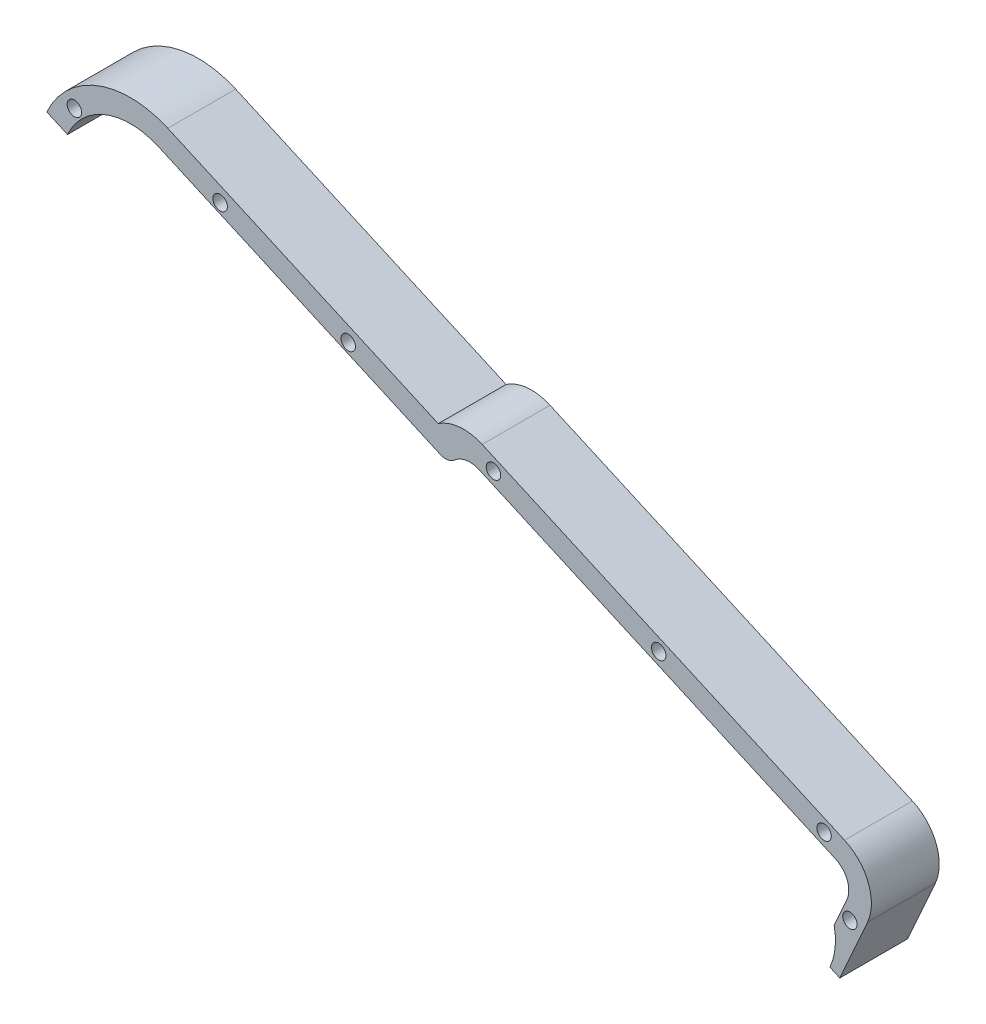
ISO-10303-21;
HEADER;
FILE_DESCRIPTION(('STEP AP214'),'2;1');
FILE_NAME('part.step','',(''),(''),'','','');
FILE_SCHEMA(('AUTOMOTIVE_DESIGN { 1 0 10303 214 1 1 1 1 }'));
ENDSEC;
DATA;
#1=APPLICATION_CONTEXT('core data for automotive mechanical design processes');
#2=APPLICATION_PROTOCOL_DEFINITION('international standard','automotive_design',2000,#1);
#3=PRODUCT_CONTEXT('',#1,'mechanical');
#4=PRODUCT('Part','Part','',(#3));
#5=PRODUCT_RELATED_PRODUCT_CATEGORY('part','',(#4));
#6=PRODUCT_DEFINITION_FORMATION('','',#4);
#7=PRODUCT_DEFINITION_CONTEXT('part definition',#1,'design');
#8=PRODUCT_DEFINITION('design','',#6,#7);
#9=PRODUCT_DEFINITION_SHAPE('','',#8);
#10=(LENGTH_UNIT() NAMED_UNIT(*) SI_UNIT(.MILLI.,.METRE.));
#11=(NAMED_UNIT(*) PLANE_ANGLE_UNIT() SI_UNIT($,.RADIAN.));
#12=(NAMED_UNIT(*) SI_UNIT($,.STERADIAN.) SOLID_ANGLE_UNIT());
#13=UNCERTAINTY_MEASURE_WITH_UNIT(LENGTH_MEASURE(1.E-05),#10,'distance_accuracy_value','');
#14=(GEOMETRIC_REPRESENTATION_CONTEXT(3) GLOBAL_UNCERTAINTY_ASSIGNED_CONTEXT((#13)) GLOBAL_UNIT_ASSIGNED_CONTEXT((#10,
#11,#12)) REPRESENTATION_CONTEXT('',''));
#15=CARTESIAN_POINT('',(0.,0.,0.));
#16=DIRECTION('',(0.,0.,1.));
#17=DIRECTION('',(1.,0.,0.));
#18=AXIS2_PLACEMENT_3D('',#15,#16,#17);
#19=CARTESIAN_POINT('',(-76.7868238041878,81.7037234737728,0.));
#20=DIRECTION('',(0.,0.,1.));
#21=DIRECTION('',(1.,0.,0.));
#22=AXIS2_PLACEMENT_3D('',#19,#20,#21);
#23=CYLINDRICAL_SURFACE('',#22,5.00000000000001);
#24=CARTESIAN_POINT('',(-76.7868238041878,81.7037234737728,15.));
#25=DIRECTION('',(0.,0.,-1.));
#26=DIRECTION('',(-1.,0.,0.));
#27=AXIS2_PLACEMENT_3D('',#24,#25,#26);
#28=CIRCLE('',#27,5.00000000000001);
#29=CARTESIAN_POINT('',(-74.7510627846422,86.27052509759,15.));
#30=VERTEX_POINT('',#29);
#31=CARTESIAN_POINT('',(-72.2200221803707,79.6679624542272,15.));
#32=VERTEX_POINT('',#31);
#33=EDGE_CURVE('E177',#30,#32,#28,.T.);
#34=ORIENTED_EDGE('',*,*,#33,.F.);
#35=DIRECTION('',(0.,0.,1.));
#36=VECTOR('',#35,1.);
#37=CARTESIAN_POINT('',(-74.7510627846422,86.27052509759,0.));
#38=LINE('',#37,#36);
#39=CARTESIAN_POINT('',(-74.7510627846422,86.27052509759,0.));
#40=VERTEX_POINT('',#39);
#41=EDGE_CURVE('E11',#40,#30,#38,.T.);
#42=ORIENTED_EDGE('',*,*,#41,.F.);
#43=CARTESIAN_POINT('',(-76.7868238041878,81.7037234737728,0.));
#44=DIRECTION('',(0.,0.,-1.));
#45=DIRECTION('',(-1.,0.,0.));
#46=AXIS2_PLACEMENT_3D('',#43,#44,#45);
#47=CIRCLE('',#46,5.00000000000001);
#48=CARTESIAN_POINT('',(-72.2200221803707,79.6679624542272,0.));
#49=VERTEX_POINT('',#48);
#50=EDGE_CURVE('E222',#40,#49,#47,.T.);
#51=ORIENTED_EDGE('',*,*,#50,.T.);
#52=DIRECTION('',(0.,0.,1.));
#53=VECTOR('',#52,1.);
#54=CARTESIAN_POINT('',(-72.2200221803707,79.6679624542272,0.));
#55=LINE('',#54,#53);
#56=EDGE_CURVE('E35',#49,#32,#55,.T.);
#57=ORIENTED_EDGE('',*,*,#56,.T.);
#58=EDGE_LOOP('',(#34,#42,#51,#57));
#59=FACE_BOUND('',#58,.T.);
#60=ADVANCED_FACE('F32',(#59),#23,.F.);
#61=CARTESIAN_POINT('',(-153.49279007904,121.371532814155,0.));
#62=DIRECTION('',(-0.40715220390912,-0.913360324763424,0.));
#63=DIRECTION('',(0.913360324763424,-0.40715220390912,0.));
#64=AXIS2_PLACEMENT_3D('',#61,#62,#63);
#65=PLANE('',#64);
#66=DIRECTION('',(0.913360324763424,-0.40715220390912,0.));
#67=VECTOR('',#66,1.);
#68=CARTESIAN_POINT('',(-153.49279007904,121.371532814155,15.));
#69=LINE('',#68,#67);
#70=CARTESIAN_POINT('',(-153.49279007904,121.371532814155,15.));
#71=VERTEX_POINT('',#70);
#72=EDGE_CURVE('E220',#71,#30,#69,.T.);
#73=ORIENTED_EDGE('',*,*,#72,.F.);
#74=DIRECTION('',(0.,0.,1.));
#75=VECTOR('',#74,1.);
#76=CARTESIAN_POINT('',(-153.49279007904,121.371532814155,0.));
#77=LINE('',#76,#75);
#78=CARTESIAN_POINT('',(-153.49279007904,121.371532814155,0.));
#79=VERTEX_POINT('',#78);
#80=EDGE_CURVE('E41',#79,#71,#77,.T.);
#81=ORIENTED_EDGE('',*,*,#80,.F.);
#82=DIRECTION('',(0.913360324763424,-0.40715220390912,0.));
#83=VECTOR('',#82,1.);
#84=CARTESIAN_POINT('',(-153.49279007904,121.371532814155,0.));
#85=LINE('',#84,#83);
#86=EDGE_CURVE('E167',#79,#40,#85,.T.);
#87=ORIENTED_EDGE('',*,*,#86,.T.);
#88=ORIENTED_EDGE('',*,*,#41,.T.);
#89=EDGE_LOOP('',(#73,#81,#87,#88));
#90=FACE_BOUND('',#89,.T.);
#91=ADVANCED_FACE('F250',(#90),#65,.T.);
#92=CARTESIAN_POINT('',(-155.528551098586,116.804731190338,0.));
#93=DIRECTION('',(0.,0.,1.));
#94=DIRECTION('',(1.,0.,0.));
#95=AXIS2_PLACEMENT_3D('',#92,#93,#94);
#96=CYLINDRICAL_SURFACE('',#95,5.00000000000001);
#97=CARTESIAN_POINT('',(-155.528551098586,116.804731190338,15.));
#98=DIRECTION('',(0.,0.,-1.));
#99=DIRECTION('',(-1.,0.,0.));
#100=AXIS2_PLACEMENT_3D('',#97,#98,#99);
#101=CIRCLE('',#100,5.00000000000001);
#102=CARTESIAN_POINT('',(-158.874492831978,120.520195349328,15.));
#103=VERTEX_POINT('',#102);
#104=EDGE_CURVE('E154',#103,#71,#101,.T.);
#105=ORIENTED_EDGE('',*,*,#104,.F.);
#106=DIRECTION('',(0.,0.,1.));
#107=VECTOR('',#106,1.);
#108=CARTESIAN_POINT('',(-158.874492831978,120.520195349328,0.));
#109=LINE('',#108,#107);
#110=CARTESIAN_POINT('',(-158.874492831978,120.520195349328,0.));
#111=VERTEX_POINT('',#110);
#112=EDGE_CURVE('E149',#111,#103,#109,.T.);
#113=ORIENTED_EDGE('',*,*,#112,.F.);
#114=CARTESIAN_POINT('',(-155.528551098586,116.804731190338,0.));
#115=DIRECTION('',(0.,0.,-1.));
#116=DIRECTION('',(-1.,0.,0.));
#117=AXIS2_PLACEMENT_3D('',#114,#115,#116);
#118=CIRCLE('',#117,5.00000000000001);
#119=EDGE_CURVE('E152',#111,#79,#118,.T.);
#120=ORIENTED_EDGE('',*,*,#119,.T.);
#121=ORIENTED_EDGE('',*,*,#80,.T.);
#122=EDGE_LOOP('',(#105,#113,#120,#121));
#123=FACE_BOUND('',#122,.T.);
#124=ADVANCED_FACE('F151',(#123),#96,.F.);
#125=CARTESIAN_POINT('',(-160.882057872014,122.749473844722,0.));
#126=DIRECTION('',(0.,0.,1.));
#127=DIRECTION('',(1.,0.,0.));
#128=AXIS2_PLACEMENT_3D('',#125,#126,#127);
#129=CYLINDRICAL_SURFACE('',#128,3.);
#130=CARTESIAN_POINT('',(-160.882057872014,122.749473844722,15.));
#131=DIRECTION('',(0.,0.,1.));
#132=DIRECTION('',(1.,0.,0.));
#133=AXIS2_PLACEMENT_3D('',#130,#131,#132);
#134=CIRCLE('',#133,3.);
#135=CARTESIAN_POINT('',(-162.103514483741,120.009392870432,15.));
#136=VERTEX_POINT('',#135);
#137=EDGE_CURVE('E217',#136,#103,#134,.T.);
#138=ORIENTED_EDGE('',*,*,#137,.F.);
#139=DIRECTION('',(0.,0.,1.));
#140=VECTOR('',#139,1.);
#141=CARTESIAN_POINT('',(-162.103514483741,120.009392870432,0.));
#142=LINE('',#141,#140);
#143=CARTESIAN_POINT('',(-162.103514483741,120.009392870432,0.));
#144=VERTEX_POINT('',#143);
#145=EDGE_CURVE('E159',#144,#136,#142,.T.);
#146=ORIENTED_EDGE('',*,*,#145,.F.);
#147=CARTESIAN_POINT('',(-160.882057872014,122.749473844722,0.));
#148=DIRECTION('',(0.,0.,1.));
#149=DIRECTION('',(1.,0.,0.));
#150=AXIS2_PLACEMENT_3D('',#147,#148,#149);
#151=CIRCLE('',#150,3.);
#152=EDGE_CURVE('E165',#144,#111,#151,.T.);
#153=ORIENTED_EDGE('',*,*,#152,.T.);
#154=ORIENTED_EDGE('',*,*,#112,.T.);
#155=EDGE_LOOP('',(#138,#146,#153,#154));
#156=FACE_BOUND('',#155,.T.);
#157=ADVANCED_FACE('F169',(#156),#129,.T.);
#158=CARTESIAN_POINT('',(-224.335121241539,147.750619588163,0.));
#159=DIRECTION('',(-0.40715220390912,-0.913360324763423,0.));
#160=DIRECTION('',(0.913360324763423,-0.40715220390912,0.));
#161=AXIS2_PLACEMENT_3D('',#158,#159,#160);
#162=PLANE('',#161);
#163=DIRECTION('',(0.913360324763423,-0.40715220390912,0.));
#164=VECTOR('',#163,1.);
#165=CARTESIAN_POINT('',(-224.335121241539,147.750619588163,15.));
#166=LINE('',#165,#164);
#167=CARTESIAN_POINT('',(-224.335121241539,147.750619588163,15.));
#168=VERTEX_POINT('',#167);
#169=EDGE_CURVE('E214',#168,#136,#166,.T.);
#170=ORIENTED_EDGE('',*,*,#169,.F.);
#171=DIRECTION('',(0.,0.,1.));
#172=VECTOR('',#171,1.);
#173=CARTESIAN_POINT('',(-224.335121241539,147.750619588163,0.));
#174=LINE('',#173,#172);
#175=CARTESIAN_POINT('',(-224.335121241539,147.750619588163,0.));
#176=VERTEX_POINT('',#175);
#177=EDGE_CURVE('E226',#176,#168,#174,.T.);
#178=ORIENTED_EDGE('',*,*,#177,.F.);
#179=DIRECTION('',(0.913360324763423,-0.40715220390912,0.));
#180=VECTOR('',#179,1.);
#181=CARTESIAN_POINT('',(-224.335121241539,147.750619588163,0.));
#182=LINE('',#181,#180);
#183=EDGE_CURVE('E170',#176,#144,#182,.T.);
#184=ORIENTED_EDGE('',*,*,#183,.T.);
#185=ORIENTED_EDGE('',*,*,#145,.T.);
#186=EDGE_LOOP('',(#170,#178,#184,#185));
#187=FACE_BOUND('',#186,.T.);
#188=ADVANCED_FACE('F263',(#187),#162,.T.);
#189=CARTESIAN_POINT('',(-230.544192351153,133.821874635521,0.));
#190=DIRECTION('',(0.,0.,1.));
#191=DIRECTION('',(1.,0.,0.));
#192=AXIS2_PLACEMENT_3D('',#189,#190,#191);
#193=CYLINDRICAL_SURFACE('',#192,15.25);
#194=CARTESIAN_POINT('',(-230.544192351153,133.821874635521,15.));
#195=DIRECTION('',(0.,0.,-1.));
#196=DIRECTION('',(-1.,0.,0.));
#197=AXIS2_PLACEMENT_3D('',#194,#195,#196);
#198=CIRCLE('',#197,15.25);
#199=CARTESIAN_POINT('',(-244.472937303795,140.030945745135,15.));
#200=VERTEX_POINT('',#199);
#201=EDGE_CURVE('E211',#200,#168,#198,.T.);
#202=ORIENTED_EDGE('',*,*,#201,.F.);
#203=DIRECTION('',(0.,0.,1.));
#204=VECTOR('',#203,1.);
#205=CARTESIAN_POINT('',(-244.472937303795,140.030945745135,0.));
#206=LINE('',#205,#204);
#207=CARTESIAN_POINT('',(-244.472937303795,140.030945745135,0.));
#208=VERTEX_POINT('',#207);
#209=EDGE_CURVE('E228',#208,#200,#206,.T.);
#210=ORIENTED_EDGE('',*,*,#209,.F.);
#211=CARTESIAN_POINT('',(-230.544192351153,133.821874635521,0.));
#212=DIRECTION('',(0.,0.,-1.));
#213=DIRECTION('',(-1.,0.,0.));
#214=AXIS2_PLACEMENT_3D('',#211,#212,#213);
#215=CIRCLE('',#214,15.25);
#216=EDGE_CURVE('E172',#208,#176,#215,.T.);
#217=ORIENTED_EDGE('',*,*,#216,.T.);
#218=ORIENTED_EDGE('',*,*,#177,.T.);
#219=EDGE_LOOP('',(#202,#210,#217,#218));
#220=FACE_BOUND('',#219,.T.);
#221=ADVANCED_FACE('F266',(#220),#193,.F.);
#222=CARTESIAN_POINT('',(-249.039738927612,142.066706764681,0.));
#223=DIRECTION('',(-0.407152203909127,-0.913360324763421,0.));
#224=DIRECTION('',(0.913360324763421,-0.407152203909127,0.));
#225=AXIS2_PLACEMENT_3D('',#222,#223,#224);
#226=PLANE('',#225);
#227=DIRECTION('',(0.91336032476342,-0.407152203909127,0.));
#228=VECTOR('',#227,1.);
#229=CARTESIAN_POINT('',(-249.039738927612,142.066706764681,15.));
#230=LINE('',#229,#228);
#231=CARTESIAN_POINT('',(-249.039738927612,142.066706764681,15.));
#232=VERTEX_POINT('',#231);
#233=EDGE_CURVE('E208',#232,#200,#230,.T.);
#234=ORIENTED_EDGE('',*,*,#233,.F.);
#235=DIRECTION('',(0.,0.,1.));
#236=VECTOR('',#235,1.);
#237=CARTESIAN_POINT('',(-249.039738927612,142.066706764681,0.));
#238=LINE('',#237,#236);
#239=CARTESIAN_POINT('',(-249.039738927612,142.066706764681,0.));
#240=VERTEX_POINT('',#239);
#241=EDGE_CURVE('E230',#240,#232,#238,.T.);
#242=ORIENTED_EDGE('',*,*,#241,.F.);
#243=DIRECTION('',(0.91336032476342,-0.407152203909127,0.));
#244=VECTOR('',#243,1.);
#245=CARTESIAN_POINT('',(-249.039738927612,142.066706764681,0.));
#246=LINE('',#245,#244);
#247=EDGE_CURVE('E418',#240,#208,#246,.T.);
#248=ORIENTED_EDGE('',*,*,#247,.T.);
#249=ORIENTED_EDGE('',*,*,#209,.T.);
#250=EDGE_LOOP('',(#234,#242,#248,#249));
#251=FACE_BOUND('',#250,.T.);
#252=ADVANCED_FACE('F270',(#251),#226,.T.);
#253=CARTESIAN_POINT('',(-230.544192351153,133.821874635521,0.));
#254=DIRECTION('',(0.,0.,1.));
#255=DIRECTION('',(1.,0.,0.));
#256=AXIS2_PLACEMENT_3D('',#253,#254,#255);
#257=CYLINDRICAL_SURFACE('',#256,20.25);
#258=CARTESIAN_POINT('',(-230.544192351153,133.821874635521,15.));
#259=DIRECTION('',(0.,0.,1.));
#260=DIRECTION('',(1.,0.,0.));
#261=AXIS2_PLACEMENT_3D('',#258,#259,#260);
#262=CIRCLE('',#261,20.25);
#263=CARTESIAN_POINT('',(-222.299360221993,152.317421211981,15.));
#264=VERTEX_POINT('',#263);
#265=EDGE_CURVE('E205',#264,#232,#262,.T.);
#266=ORIENTED_EDGE('',*,*,#265,.F.);
#267=DIRECTION('',(0.,0.,1.));
#268=VECTOR('',#267,1.);
#269=CARTESIAN_POINT('',(-222.299360221993,152.317421211981,0.));
#270=LINE('',#269,#268);
#271=CARTESIAN_POINT('',(-222.299360221993,152.317421211981,0.));
#272=VERTEX_POINT('',#271);
#273=EDGE_CURVE('E232',#272,#264,#270,.T.);
#274=ORIENTED_EDGE('',*,*,#273,.F.);
#275=CARTESIAN_POINT('',(-230.544192351153,133.821874635521,0.));
#276=DIRECTION('',(0.,0.,1.));
#277=DIRECTION('',(1.,0.,0.));
#278=AXIS2_PLACEMENT_3D('',#275,#276,#277);
#279=CIRCLE('',#278,20.25);
#280=EDGE_CURVE('E415',#272,#240,#279,.T.);
#281=ORIENTED_EDGE('',*,*,#280,.T.);
#282=ORIENTED_EDGE('',*,*,#241,.T.);
#283=EDGE_LOOP('',(#266,#274,#281,#282));
#284=FACE_BOUND('',#283,.T.);
#285=ADVANCED_FACE('F274',(#284),#257,.T.);
#286=CARTESIAN_POINT('',(-162.524605275697,125.671394934437,0.));
#287=DIRECTION('',(0.407152203909121,0.913360324763423,0.));
#288=DIRECTION('',(-0.913360324763423,0.407152203909121,0.));
#289=AXIS2_PLACEMENT_3D('',#286,#287,#288);
#290=PLANE('',#289);
#291=DIRECTION('',(-0.913360324763423,0.407152203909121,0.));
#292=VECTOR('',#291,1.);
#293=CARTESIAN_POINT('',(-162.524605275697,125.671394934437,15.));
#294=LINE('',#293,#292);
#295=CARTESIAN_POINT('',(-162.524605275697,125.671394934437,15.));
#296=VERTEX_POINT('',#295);
#297=EDGE_CURVE('E202',#296,#264,#294,.T.);
#298=ORIENTED_EDGE('',*,*,#297,.F.);
#299=DIRECTION('',(0.,0.,1.));
#300=VECTOR('',#299,1.);
#301=CARTESIAN_POINT('',(-162.524605275697,125.671394934437,0.));
#302=LINE('',#301,#300);
#303=CARTESIAN_POINT('',(-162.524605275697,125.671394934437,0.));
#304=VERTEX_POINT('',#303);
#305=EDGE_CURVE('E234',#304,#296,#302,.T.);
#306=ORIENTED_EDGE('',*,*,#305,.F.);
#307=DIRECTION('',(-0.913360324763423,0.407152203909121,0.));
#308=VECTOR('',#307,1.);
#309=CARTESIAN_POINT('',(-162.524605275697,125.671394934437,0.));
#310=LINE('',#309,#308);
#311=EDGE_CURVE('E412',#304,#272,#310,.T.);
#312=ORIENTED_EDGE('',*,*,#311,.T.);
#313=ORIENTED_EDGE('',*,*,#273,.T.);
#314=EDGE_LOOP('',(#298,#306,#312,#313));
#315=FACE_BOUND('',#314,.T.);
#316=ADVANCED_FACE('F278',(#315),#290,.T.);
#317=CARTESIAN_POINT('',(-156.88852428594,117.410971756603,0.));
#318=DIRECTION('',(0.,0.,1.));
#319=DIRECTION('',(1.,0.,0.));
#320=AXIS2_PLACEMENT_3D('',#317,#318,#319);
#321=CYLINDRICAL_SURFACE('',#320,10.);
#322=CARTESIAN_POINT('',(-156.88852428594,117.410971756603,15.));
#323=DIRECTION('',(0.,0.,1.));
#324=DIRECTION('',(1.,0.,0.));
#325=AXIS2_PLACEMENT_3D('',#322,#323,#324);
#326=CIRCLE('',#325,10.);
#327=CARTESIAN_POINT('',(-152.817002246849,126.544575004237,15.));
#328=VERTEX_POINT('',#327);
#329=EDGE_CURVE('E199',#328,#296,#326,.T.);
#330=ORIENTED_EDGE('',*,*,#329,.F.);
#331=DIRECTION('',(0.,0.,1.));
#332=VECTOR('',#331,1.);
#333=CARTESIAN_POINT('',(-152.817002246849,126.544575004237,0.));
#334=LINE('',#333,#332);
#335=CARTESIAN_POINT('',(-152.817002246849,126.544575004237,0.));
#336=VERTEX_POINT('',#335);
#337=EDGE_CURVE('E236',#336,#328,#334,.T.);
#338=ORIENTED_EDGE('',*,*,#337,.F.);
#339=CARTESIAN_POINT('',(-156.88852428594,117.410971756603,0.));
#340=DIRECTION('',(0.,0.,1.));
#341=DIRECTION('',(1.,0.,0.));
#342=AXIS2_PLACEMENT_3D('',#339,#340,#341);
#343=CIRCLE('',#342,10.);
#344=EDGE_CURVE('E409',#336,#304,#343,.T.);
#345=ORIENTED_EDGE('',*,*,#344,.T.);
#346=ORIENTED_EDGE('',*,*,#305,.T.);
#347=EDGE_LOOP('',(#330,#338,#345,#346));
#348=FACE_BOUND('',#347,.T.);
#349=ADVANCED_FACE('F282',(#348),#321,.T.);
#350=CARTESIAN_POINT('',(-72.7153017650966,90.837326721407,0.));
#351=DIRECTION('',(0.40715220390912,0.913360324763423,0.));
#352=DIRECTION('',(-0.913360324763423,0.40715220390912,0.));
#353=AXIS2_PLACEMENT_3D('',#350,#351,#352);
#354=PLANE('',#353);
#355=DIRECTION('',(-0.913360324763423,0.40715220390912,0.));
#356=VECTOR('',#355,1.);
#357=CARTESIAN_POINT('',(-72.7153017650966,90.837326721407,15.));
#358=LINE('',#357,#356);
#359=CARTESIAN_POINT('',(-72.7153017650967,90.8373267214067,15.));
#360=VERTEX_POINT('',#359);
#361=EDGE_CURVE('E196',#360,#328,#358,.T.);
#362=ORIENTED_EDGE('',*,*,#361,.F.);
#363=DIRECTION('',(0.,0.,1.));
#364=VECTOR('',#363,1.);
#365=CARTESIAN_POINT('',(-72.7153017650967,90.8373267214067,0.));
#366=LINE('',#365,#364);
#367=CARTESIAN_POINT('',(-72.7153017650967,90.8373267214067,0.));
#368=VERTEX_POINT('',#367);
#369=EDGE_CURVE('E238',#368,#360,#366,.T.);
#370=ORIENTED_EDGE('',*,*,#369,.F.);
#371=DIRECTION('',(-0.913360324763423,0.40715220390912,0.));
#372=VECTOR('',#371,1.);
#373=CARTESIAN_POINT('',(-72.7153017650966,90.837326721407,0.));
#374=LINE('',#373,#372);
#375=EDGE_CURVE('E406',#368,#336,#374,.T.);
#376=ORIENTED_EDGE('',*,*,#375,.T.);
#377=ORIENTED_EDGE('',*,*,#337,.T.);
#378=EDGE_LOOP('',(#362,#370,#376,#377));
#379=FACE_BOUND('',#378,.T.);
#380=ADVANCED_FACE('F286',(#379),#354,.T.);
#381=CARTESIAN_POINT('',(-76.7868238041878,81.7037234737728,0.));
#382=DIRECTION('',(0.,0.,1.));
#383=DIRECTION('',(1.,0.,0.));
#384=AXIS2_PLACEMENT_3D('',#381,#382,#383);
#385=CYLINDRICAL_SURFACE('',#384,9.99999999999968);
#386=CARTESIAN_POINT('',(-76.7868238041878,81.7037234737728,15.));
#387=DIRECTION('',(0.,0.,1.));
#388=DIRECTION('',(1.,0.,0.));
#389=AXIS2_PLACEMENT_3D('',#386,#387,#388);
#390=CIRCLE('',#389,9.99999999999968);
#391=CARTESIAN_POINT('',(-67.6532205565541,77.6322014346818,15.));
#392=VERTEX_POINT('',#391);
#393=EDGE_CURVE('E193',#392,#360,#390,.T.);
#394=ORIENTED_EDGE('',*,*,#393,.F.);
#395=DIRECTION('',(0.,0.,1.));
#396=VECTOR('',#395,1.);
#397=CARTESIAN_POINT('',(-67.6532205565541,77.6322014346818,0.));
#398=LINE('',#397,#396);
#399=CARTESIAN_POINT('',(-67.6532205565541,77.6322014346818,0.));
#400=VERTEX_POINT('',#399);
#401=EDGE_CURVE('E240',#400,#392,#398,.T.);
#402=ORIENTED_EDGE('',*,*,#401,.F.);
#403=CARTESIAN_POINT('',(-76.7868238041878,81.7037234737728,0.));
#404=DIRECTION('',(0.,0.,1.));
#405=DIRECTION('',(1.,0.,0.));
#406=AXIS2_PLACEMENT_3D('',#403,#404,#405);
#407=CIRCLE('',#406,9.99999999999968);
#408=EDGE_CURVE('E403',#400,#368,#407,.T.);
#409=ORIENTED_EDGE('',*,*,#408,.T.);
#410=ORIENTED_EDGE('',*,*,#369,.T.);
#411=EDGE_LOOP('',(#394,#402,#409,#410));
#412=FACE_BOUND('',#411,.T.);
#413=ADVANCED_FACE('F290',(#412),#385,.T.);
#414=CARTESIAN_POINT('',(-73.7605036151916,63.9317965632293,0.));
#415=DIRECTION('',(0.91336032476342,-0.407152203909127,0.));
#416=DIRECTION('',(0.407152203909127,0.91336032476342,0.));
#417=AXIS2_PLACEMENT_3D('',#414,#415,#416);
#418=PLANE('',#417);
#419=DIRECTION('',(0.407152203909127,0.91336032476342,0.));
#420=VECTOR('',#419,1.);
#421=CARTESIAN_POINT('',(-73.7605036151916,63.9317965632293,15.));
#422=LINE('',#421,#420);
#423=CARTESIAN_POINT('',(-73.7605036151916,63.9317965632293,15.));
#424=VERTEX_POINT('',#423);
#425=EDGE_CURVE('E190',#424,#392,#422,.T.);
#426=ORIENTED_EDGE('',*,*,#425,.F.);
#427=DIRECTION('',(0.,0.,1.));
#428=VECTOR('',#427,1.);
#429=CARTESIAN_POINT('',(-73.7605036151916,63.9317965632293,0.));
#430=LINE('',#429,#428);
#431=CARTESIAN_POINT('',(-73.7605036151916,63.9317965632293,0.));
#432=VERTEX_POINT('',#431);
#433=EDGE_CURVE('E242',#432,#424,#430,.T.);
#434=ORIENTED_EDGE('',*,*,#433,.F.);
#435=DIRECTION('',(0.407152203909127,0.91336032476342,0.));
#436=VECTOR('',#435,1.);
#437=CARTESIAN_POINT('',(-73.7605036151916,63.9317965632293,0.));
#438=LINE('',#437,#436);
#439=EDGE_CURVE('E400',#432,#400,#438,.T.);
#440=ORIENTED_EDGE('',*,*,#439,.T.);
#441=ORIENTED_EDGE('',*,*,#401,.T.);
#442=EDGE_LOOP('',(#426,#434,#440,#441));
#443=FACE_BOUND('',#442,.T.);
#444=ADVANCED_FACE('F294',(#443),#418,.T.);
#445=CARTESIAN_POINT('',(-75.9417065742245,64.9041199364538,0.));
#446=DIRECTION('',(-0.407152203909127,-0.91336032476342,0.));
#447=DIRECTION('',(0.91336032476342,-0.407152203909127,0.));
#448=AXIS2_PLACEMENT_3D('',#445,#446,#447);
#449=PLANE('',#448);
#450=DIRECTION('',(0.91336032476342,-0.407152203909127,0.));
#451=VECTOR('',#450,1.);
#452=CARTESIAN_POINT('',(-75.9417065742245,64.9041199364538,15.));
#453=LINE('',#452,#451);
#454=CARTESIAN_POINT('',(-75.9417065742242,64.9041199364537,15.));
#455=VERTEX_POINT('',#454);
#456=EDGE_CURVE('E187',#455,#424,#453,.T.);
#457=ORIENTED_EDGE('',*,*,#456,.F.);
#458=DIRECTION('',(0.,0.,1.));
#459=VECTOR('',#458,1.);
#460=CARTESIAN_POINT('',(-75.9417065742242,64.9041199364537,0.));
#461=LINE('',#460,#459);
#462=CARTESIAN_POINT('',(-75.9417065742242,64.9041199364537,0.));
#463=VERTEX_POINT('',#462);
#464=EDGE_CURVE('E244',#463,#455,#461,.T.);
#465=ORIENTED_EDGE('',*,*,#464,.F.);
#466=DIRECTION('',(0.91336032476342,-0.407152203909127,0.));
#467=VECTOR('',#466,1.);
#468=CARTESIAN_POINT('',(-75.9417065742245,64.9041199364538,0.));
#469=LINE('',#468,#467);
#470=EDGE_CURVE('E397',#463,#432,#469,.T.);
#471=ORIENTED_EDGE('',*,*,#470,.T.);
#472=ORIENTED_EDGE('',*,*,#433,.T.);
#473=EDGE_LOOP('',(#457,#465,#471,#472));
#474=FACE_BOUND('',#473,.T.);
#475=ADVANCED_FACE('F298',(#474),#449,.T.);
#476=CARTESIAN_POINT('',(-88.7287511209124,70.6042507911816,0.));
#477=DIRECTION('',(0.,0.,1.));
#478=DIRECTION('',(1.,0.,0.));
#479=AXIS2_PLACEMENT_3D('',#476,#477,#478);
#480=CYLINDRICAL_SURFACE('',#479,14.0000000000003);
#481=CARTESIAN_POINT('',(-88.7287511209124,70.6042507911816,15.));
#482=DIRECTION('',(0.,0.,-1.));
#483=DIRECTION('',(-1.,0.,0.));
#484=AXIS2_PLACEMENT_3D('',#481,#482,#483);
#485=CIRCLE('',#484,14.0000000000003);
#486=CARTESIAN_POINT('',(-75.0118010764204,73.4051937532801,15.));
#487=VERTEX_POINT('',#486);
#488=EDGE_CURVE('E184',#487,#455,#485,.T.);
#489=ORIENTED_EDGE('',*,*,#488,.F.);
#490=DIRECTION('',(0.,0.,1.));
#491=VECTOR('',#490,1.);
#492=CARTESIAN_POINT('',(-75.0118010764204,73.4051937532801,0.));
#493=LINE('',#492,#491);
#494=CARTESIAN_POINT('',(-75.0118010764204,73.4051937532801,0.));
#495=VERTEX_POINT('',#494);
#496=EDGE_CURVE('E245',#495,#487,#493,.T.);
#497=ORIENTED_EDGE('',*,*,#496,.F.);
#498=CARTESIAN_POINT('',(-88.7287511209124,70.6042507911816,0.));
#499=DIRECTION('',(0.,0.,-1.));
#500=DIRECTION('',(-1.,0.,0.));
#501=AXIS2_PLACEMENT_3D('',#498,#499,#500);
#502=CIRCLE('',#501,14.0000000000003);
#503=EDGE_CURVE('E394',#495,#463,#502,.T.);
#504=ORIENTED_EDGE('',*,*,#503,.T.);
#505=ORIENTED_EDGE('',*,*,#464,.T.);
#506=EDGE_LOOP('',(#489,#497,#504,#505));
#507=FACE_BOUND('',#506,.T.);
#508=ADVANCED_FACE('F302',(#507),#480,.F.);
#509=CARTESIAN_POINT('',(-72.2200221803707,79.6679624542272,0.));
#510=DIRECTION('',(-0.913360324763424,0.407152203909119,0.));
#511=DIRECTION('',(-0.407152203909119,-0.913360324763424,0.));
#512=AXIS2_PLACEMENT_3D('',#509,#510,#511);
#513=PLANE('',#512);
#514=DIRECTION('',(-0.407152203909119,-0.913360324763424,0.));
#515=VECTOR('',#514,1.);
#516=CARTESIAN_POINT('',(-72.2200221803707,79.6679624542272,15.));
#517=LINE('',#516,#515);
#518=EDGE_CURVE('E180',#32,#487,#517,.T.);
#519=ORIENTED_EDGE('',*,*,#518,.F.);
#520=ORIENTED_EDGE('',*,*,#56,.F.);
#521=DIRECTION('',(-0.407152203909119,-0.913360324763424,0.));
#522=VECTOR('',#521,1.);
#523=CARTESIAN_POINT('',(-72.2200221803707,79.6679624542272,0.));
#524=LINE('',#523,#522);
#525=EDGE_CURVE('E392',#49,#495,#524,.T.);
#526=ORIENTED_EDGE('',*,*,#525,.T.);
#527=ORIENTED_EDGE('',*,*,#496,.T.);
#528=EDGE_LOOP('',(#519,#520,#526,#527));
#529=FACE_BOUND('',#528,.T.);
#530=ADVANCED_FACE('F247',(#529),#513,.T.);
#531=CARTESIAN_POINT('',(-76.7868238041878,81.7037234737728,0.));
#532=DIRECTION('',(0.,0.,-1.));
#533=DIRECTION('',(-1.,0.,0.));
#534=AXIS2_PLACEMENT_3D('',#531,#532,#533);
#535=PLANE('',#534);
#536=CARTESIAN_POINT('',(-242.947351213455,145.810375385677,0.));
#537=DIRECTION('',(0.,0.,1.));
#538=DIRECTION('',(-1.,0.,0.));
#539=AXIS2_PLACEMENT_3D('',#536,#537,#538);
#540=CIRCLE('',#539,1.59999999999999);
#541=CARTESIAN_POINT('',(-244.547351213455,145.810375385677,0.));
#542=VERTEX_POINT('',#541);
#543=EDGE_CURVE('E349',#542,#542,#540,.T.);
#544=ORIENTED_EDGE('',*,*,#543,.T.);
#545=EDGE_LOOP('',(#544));
#546=FACE_BOUND('',#545,.T.);
#547=CARTESIAN_POINT('',(-182.419602219367,131.25549106178,0.));
#548=DIRECTION('',(0.,0.,1.));
#549=DIRECTION('',(-1.,0.,0.));
#550=AXIS2_PLACEMENT_3D('',#547,#548,#549);
#551=CIRCLE('',#550,1.59999999999999);
#552=CARTESIAN_POINT('',(-184.019602219367,131.25549106178,0.));
#553=VERTEX_POINT('',#552);
#554=EDGE_CURVE('E357',#553,#553,#551,.T.);
#555=ORIENTED_EDGE('',*,*,#554,.T.);
#556=EDGE_LOOP('',(#555));
#557=FACE_BOUND('',#556,.T.);
#558=CARTESIAN_POINT('',(-210.733772287033,143.877209382963,0.));
#559=DIRECTION('',(0.,0.,1.));
#560=DIRECTION('',(-1.,0.,0.));
#561=AXIS2_PLACEMENT_3D('',#558,#559,#560);
#562=CIRCLE('',#561,1.59999999999999);
#563=CARTESIAN_POINT('',(-212.333772287033,143.877209382963,0.));
#564=VERTEX_POINT('',#563);
#565=EDGE_CURVE('E363',#564,#564,#562,.T.);
#566=ORIENTED_EDGE('',*,*,#565,.T.);
#567=EDGE_LOOP('',(#566));
#568=FACE_BOUND('',#567,.T.);
#569=CARTESIAN_POINT('',(-71.5234221100948,76.0728618517278,0.));
#570=DIRECTION('',(0.,0.,1.));
#571=DIRECTION('',(-1.,0.,0.));
#572=AXIS2_PLACEMENT_3D('',#569,#570,#571);
#573=CIRCLE('',#572,1.6);
#574=CARTESIAN_POINT('',(-73.1234221100948,76.0728618517278,0.));
#575=VERTEX_POINT('',#574);
#576=EDGE_CURVE('E369',#575,#575,#573,.T.);
#577=ORIENTED_EDGE('',*,*,#576,.T.);
#578=EDGE_LOOP('',(#577));
#579=FACE_BOUND('',#578,.T.);
#580=CARTESIAN_POINT('',(-77.2496195252085,90.1214618945486,0.));
#581=DIRECTION('',(0.,0.,1.));
#582=DIRECTION('',(-1.,0.,0.));
#583=AXIS2_PLACEMENT_3D('',#580,#581,#582);
#584=CIRCLE('',#583,1.6);
#585=CARTESIAN_POINT('',(-78.8496195252085,90.1214618945486,0.));
#586=VERTEX_POINT('',#585);
#587=EDGE_CURVE('E375',#586,#586,#584,.T.);
#588=ORIENTED_EDGE('',*,*,#587,.T.);
#589=EDGE_LOOP('',(#588));
#590=FACE_BOUND('',#589,.T.);
#591=CARTESIAN_POINT('',(-150.318445506282,122.693638207278,0.));
#592=DIRECTION('',(0.,0.,1.));
#593=DIRECTION('',(-1.,0.,0.));
#594=AXIS2_PLACEMENT_3D('',#591,#592,#593);
#595=CIRCLE('',#594,1.59999999999999);
#596=CARTESIAN_POINT('',(-151.918445506282,122.693638207278,0.));
#597=VERTEX_POINT('',#596);
#598=EDGE_CURVE('E381',#597,#597,#595,.T.);
#599=ORIENTED_EDGE('',*,*,#598,.T.);
#600=EDGE_LOOP('',(#599));
#601=FACE_BOUND('',#600,.T.);
#602=CARTESIAN_POINT('',(-113.784032515745,106.407550050913,0.));
#603=DIRECTION('',(0.,0.,1.));
#604=DIRECTION('',(-1.,0.,0.));
#605=AXIS2_PLACEMENT_3D('',#602,#603,#604);
#606=CIRCLE('',#605,1.6);
#607=CARTESIAN_POINT('',(-115.384032515745,106.407550050913,0.));
#608=VERTEX_POINT('',#607);
#609=EDGE_CURVE('E181',#608,#608,#606,.T.);
#610=ORIENTED_EDGE('',*,*,#609,.T.);
#611=EDGE_LOOP('',(#610));
#612=FACE_BOUND('',#611,.T.);
#613=ORIENTED_EDGE('',*,*,#50,.F.);
#614=ORIENTED_EDGE('',*,*,#86,.F.);
#615=ORIENTED_EDGE('',*,*,#119,.F.);
#616=ORIENTED_EDGE('',*,*,#152,.F.);
#617=ORIENTED_EDGE('',*,*,#183,.F.);
#618=ORIENTED_EDGE('',*,*,#216,.F.);
#619=ORIENTED_EDGE('',*,*,#247,.F.);
#620=ORIENTED_EDGE('',*,*,#280,.F.);
#621=ORIENTED_EDGE('',*,*,#311,.F.);
#622=ORIENTED_EDGE('',*,*,#344,.F.);
#623=ORIENTED_EDGE('',*,*,#375,.F.);
#624=ORIENTED_EDGE('',*,*,#408,.F.);
#625=ORIENTED_EDGE('',*,*,#439,.F.);
#626=ORIENTED_EDGE('',*,*,#470,.F.);
#627=ORIENTED_EDGE('',*,*,#503,.F.);
#628=ORIENTED_EDGE('',*,*,#525,.F.);
#629=EDGE_LOOP('',(#613,#614,#615,#616,#617,#618,#619,#620,#621,#622,#623,#624,#625,#626,#627,#628));
#630=FACE_BOUND('',#629,.T.);
#631=ADVANCED_FACE('F163',(#546,#557,#568,#579,#590,#601,#612,#630),#535,.T.);
#632=CARTESIAN_POINT('',(-76.7868238041878,81.7037234737728,15.));
#633=DIRECTION('',(0.,0.,-1.));
#634=DIRECTION('',(-1.,0.,0.));
#635=AXIS2_PLACEMENT_3D('',#632,#633,#634);
#636=PLANE('',#635);
#637=CARTESIAN_POINT('',(-242.947351213455,145.810375385677,15.));
#638=DIRECTION('',(0.,0.,1.));
#639=DIRECTION('',(-1.,0.,0.));
#640=AXIS2_PLACEMENT_3D('',#637,#638,#639);
#641=CIRCLE('',#640,1.59999999999999);
#642=CARTESIAN_POINT('',(-244.547351213455,145.810375385677,15.));
#643=VERTEX_POINT('',#642);
#644=EDGE_CURVE('E352',#643,#643,#641,.T.);
#645=ORIENTED_EDGE('',*,*,#644,.F.);
#646=EDGE_LOOP('',(#645));
#647=FACE_BOUND('',#646,.T.);
#648=CARTESIAN_POINT('',(-182.419602219367,131.25549106178,15.));
#649=DIRECTION('',(0.,0.,1.));
#650=DIRECTION('',(-1.,0.,0.));
#651=AXIS2_PLACEMENT_3D('',#648,#649,#650);
#652=CIRCLE('',#651,1.59999999999999);
#653=CARTESIAN_POINT('',(-184.019602219367,131.25549106178,15.));
#654=VERTEX_POINT('',#653);
#655=EDGE_CURVE('E354',#654,#654,#652,.T.);
#656=ORIENTED_EDGE('',*,*,#655,.F.);
#657=EDGE_LOOP('',(#656));
#658=FACE_BOUND('',#657,.T.);
#659=CARTESIAN_POINT('',(-210.733772287033,143.877209382963,15.));
#660=DIRECTION('',(0.,0.,1.));
#661=DIRECTION('',(-1.,0.,0.));
#662=AXIS2_PLACEMENT_3D('',#659,#660,#661);
#663=CIRCLE('',#662,1.59999999999999);
#664=CARTESIAN_POINT('',(-212.333772287033,143.877209382963,15.));
#665=VERTEX_POINT('',#664);
#666=EDGE_CURVE('E360',#665,#665,#663,.T.);
#667=ORIENTED_EDGE('',*,*,#666,.F.);
#668=EDGE_LOOP('',(#667));
#669=FACE_BOUND('',#668,.T.);
#670=CARTESIAN_POINT('',(-71.5234221100948,76.0728618517278,15.));
#671=DIRECTION('',(0.,0.,1.));
#672=DIRECTION('',(-1.,0.,0.));
#673=AXIS2_PLACEMENT_3D('',#670,#671,#672);
#674=CIRCLE('',#673,1.6);
#675=CARTESIAN_POINT('',(-73.1234221100948,76.0728618517278,15.));
#676=VERTEX_POINT('',#675);
#677=EDGE_CURVE('E366',#676,#676,#674,.T.);
#678=ORIENTED_EDGE('',*,*,#677,.F.);
#679=EDGE_LOOP('',(#678));
#680=FACE_BOUND('',#679,.T.);
#681=CARTESIAN_POINT('',(-77.2496195252085,90.1214618945486,15.));
#682=DIRECTION('',(0.,0.,1.));
#683=DIRECTION('',(-1.,0.,0.));
#684=AXIS2_PLACEMENT_3D('',#681,#682,#683);
#685=CIRCLE('',#684,1.6);
#686=CARTESIAN_POINT('',(-78.8496195252085,90.1214618945486,15.));
#687=VERTEX_POINT('',#686);
#688=EDGE_CURVE('E372',#687,#687,#685,.T.);
#689=ORIENTED_EDGE('',*,*,#688,.F.);
#690=EDGE_LOOP('',(#689));
#691=FACE_BOUND('',#690,.T.);
#692=CARTESIAN_POINT('',(-150.318445506282,122.693638207278,15.));
#693=DIRECTION('',(0.,0.,1.));
#694=DIRECTION('',(-1.,0.,0.));
#695=AXIS2_PLACEMENT_3D('',#692,#693,#694);
#696=CIRCLE('',#695,1.59999999999999);
#697=CARTESIAN_POINT('',(-151.918445506282,122.693638207278,15.));
#698=VERTEX_POINT('',#697);
#699=EDGE_CURVE('E378',#698,#698,#696,.T.);
#700=ORIENTED_EDGE('',*,*,#699,.F.);
#701=EDGE_LOOP('',(#700));
#702=FACE_BOUND('',#701,.T.);
#703=CARTESIAN_POINT('',(-113.784032515745,106.407550050913,15.));
#704=DIRECTION('',(0.,0.,1.));
#705=DIRECTION('',(-1.,0.,0.));
#706=AXIS2_PLACEMENT_3D('',#703,#704,#705);
#707=CIRCLE('',#706,1.6);
#708=CARTESIAN_POINT('',(-115.384032515745,106.407550050913,15.));
#709=VERTEX_POINT('',#708);
#710=EDGE_CURVE('E384',#709,#709,#707,.T.);
#711=ORIENTED_EDGE('',*,*,#710,.F.);
#712=EDGE_LOOP('',(#711));
#713=FACE_BOUND('',#712,.T.);
#714=ORIENTED_EDGE('',*,*,#33,.T.);
#715=ORIENTED_EDGE('',*,*,#518,.T.);
#716=ORIENTED_EDGE('',*,*,#488,.T.);
#717=ORIENTED_EDGE('',*,*,#456,.T.);
#718=ORIENTED_EDGE('',*,*,#425,.T.);
#719=ORIENTED_EDGE('',*,*,#393,.T.);
#720=ORIENTED_EDGE('',*,*,#361,.T.);
#721=ORIENTED_EDGE('',*,*,#329,.T.);
#722=ORIENTED_EDGE('',*,*,#297,.T.);
#723=ORIENTED_EDGE('',*,*,#265,.T.);
#724=ORIENTED_EDGE('',*,*,#233,.T.);
#725=ORIENTED_EDGE('',*,*,#201,.T.);
#726=ORIENTED_EDGE('',*,*,#169,.T.);
#727=ORIENTED_EDGE('',*,*,#137,.T.);
#728=ORIENTED_EDGE('',*,*,#104,.T.);
#729=ORIENTED_EDGE('',*,*,#72,.T.);
#730=EDGE_LOOP('',(#714,#715,#716,#717,#718,#719,#720,#721,#722,#723,#724,#725,#726,#727,#728,#729));
#731=FACE_BOUND('',#730,.T.);
#732=ADVANCED_FACE('F249',(#647,#658,#669,#680,#691,#702,#713,#731),#636,.F.);
#733=CARTESIAN_POINT('',(-113.784032515745,106.407550050913,0.));
#734=DIRECTION('',(0.,0.,1.));
#735=DIRECTION('',(1.,0.,0.));
#736=AXIS2_PLACEMENT_3D('',#733,#734,#735);
#737=CYLINDRICAL_SURFACE('',#736,1.6);
#738=ORIENTED_EDGE('',*,*,#609,.F.);
#739=EDGE_LOOP('',(#738));
#740=FACE_BOUND('',#739,.T.);
#741=ORIENTED_EDGE('',*,*,#710,.T.);
#742=EDGE_LOOP('',(#741));
#743=FACE_BOUND('',#742,.T.);
#744=ADVANCED_FACE('F314',(#740,#743),#737,.F.);
#745=CARTESIAN_POINT('',(-150.318445506282,122.693638207278,0.));
#746=DIRECTION('',(0.,0.,1.));
#747=DIRECTION('',(1.,0.,0.));
#748=AXIS2_PLACEMENT_3D('',#745,#746,#747);
#749=CYLINDRICAL_SURFACE('',#748,1.59999999999999);
#750=ORIENTED_EDGE('',*,*,#598,.F.);
#751=EDGE_LOOP('',(#750));
#752=FACE_BOUND('',#751,.T.);
#753=ORIENTED_EDGE('',*,*,#699,.T.);
#754=EDGE_LOOP('',(#753));
#755=FACE_BOUND('',#754,.T.);
#756=ADVANCED_FACE('F321',(#752,#755),#749,.F.);
#757=CARTESIAN_POINT('',(-77.2496195252085,90.1214618945486,0.));
#758=DIRECTION('',(0.,0.,1.));
#759=DIRECTION('',(1.,0.,0.));
#760=AXIS2_PLACEMENT_3D('',#757,#758,#759);
#761=CYLINDRICAL_SURFACE('',#760,1.6);
#762=ORIENTED_EDGE('',*,*,#587,.F.);
#763=EDGE_LOOP('',(#762));
#764=FACE_BOUND('',#763,.T.);
#765=ORIENTED_EDGE('',*,*,#688,.T.);
#766=EDGE_LOOP('',(#765));
#767=FACE_BOUND('',#766,.T.);
#768=ADVANCED_FACE('F325',(#764,#767),#761,.F.);
#769=CARTESIAN_POINT('',(-71.5234221100948,76.0728618517278,0.));
#770=DIRECTION('',(0.,0.,1.));
#771=DIRECTION('',(1.,0.,0.));
#772=AXIS2_PLACEMENT_3D('',#769,#770,#771);
#773=CYLINDRICAL_SURFACE('',#772,1.6);
#774=ORIENTED_EDGE('',*,*,#576,.F.);
#775=EDGE_LOOP('',(#774));
#776=FACE_BOUND('',#775,.T.);
#777=ORIENTED_EDGE('',*,*,#677,.T.);
#778=EDGE_LOOP('',(#777));
#779=FACE_BOUND('',#778,.T.);
#780=ADVANCED_FACE('F329',(#776,#779),#773,.F.);
#781=CARTESIAN_POINT('',(-210.733772287033,143.877209382963,0.));
#782=DIRECTION('',(0.,0.,1.));
#783=DIRECTION('',(1.,0.,0.));
#784=AXIS2_PLACEMENT_3D('',#781,#782,#783);
#785=CYLINDRICAL_SURFACE('',#784,1.59999999999999);
#786=ORIENTED_EDGE('',*,*,#565,.F.);
#787=EDGE_LOOP('',(#786));
#788=FACE_BOUND('',#787,.T.);
#789=ORIENTED_EDGE('',*,*,#666,.T.);
#790=EDGE_LOOP('',(#789));
#791=FACE_BOUND('',#790,.T.);
#792=ADVANCED_FACE('F333',(#788,#791),#785,.F.);
#793=CARTESIAN_POINT('',(-182.419602219367,131.25549106178,0.));
#794=DIRECTION('',(0.,0.,1.));
#795=DIRECTION('',(1.,0.,0.));
#796=AXIS2_PLACEMENT_3D('',#793,#794,#795);
#797=CYLINDRICAL_SURFACE('',#796,1.59999999999999);
#798=ORIENTED_EDGE('',*,*,#554,.F.);
#799=EDGE_LOOP('',(#798));
#800=FACE_BOUND('',#799,.T.);
#801=ORIENTED_EDGE('',*,*,#655,.T.);
#802=EDGE_LOOP('',(#801));
#803=FACE_BOUND('',#802,.T.);
#804=ADVANCED_FACE('F337',(#800,#803),#797,.F.);
#805=CARTESIAN_POINT('',(-242.947351213455,145.810375385677,0.));
#806=DIRECTION('',(0.,0.,1.));
#807=DIRECTION('',(1.,0.,0.));
#808=AXIS2_PLACEMENT_3D('',#805,#806,#807);
#809=CYLINDRICAL_SURFACE('',#808,1.59999999999999);
#810=ORIENTED_EDGE('',*,*,#543,.F.);
#811=EDGE_LOOP('',(#810));
#812=FACE_BOUND('',#811,.T.);
#813=ORIENTED_EDGE('',*,*,#644,.T.);
#814=EDGE_LOOP('',(#813));
#815=FACE_BOUND('',#814,.T.);
#816=ADVANCED_FACE('F341',(#812,#815),#809,.F.);
#817=CLOSED_SHELL('',(#60,#91,#124,#157,#188,#221,#252,#285,#316,#349,#380,#413,#444,#475,#508,
#530,#631,#732,#744,#756,#768,#780,#792,#804,#816));
#818=MANIFOLD_SOLID_BREP('B2',#817);
#819=ADVANCED_BREP_SHAPE_REPRESENTATION('',(#18,#818),#14);
#820=SHAPE_DEFINITION_REPRESENTATION(#9,#819);
ENDSEC;
END-ISO-10303-21;
